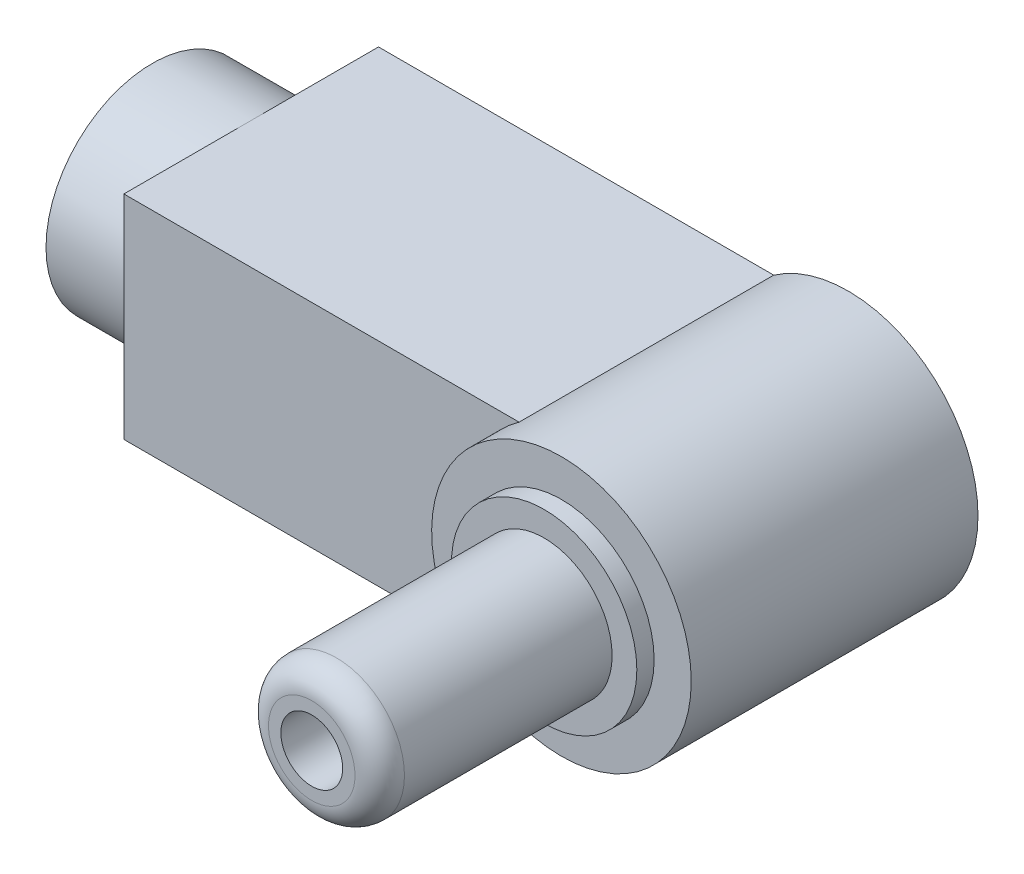
ISO-10303-21;
HEADER;
FILE_DESCRIPTION(('STEP AP214'),'2;1');
FILE_NAME('part.step','',(''),(''),'','','');
FILE_SCHEMA(('AUTOMOTIVE_DESIGN { 1 0 10303 214 1 1 1 1 }'));
ENDSEC;
DATA;
#1=APPLICATION_CONTEXT('core data for automotive mechanical design processes');
#2=APPLICATION_PROTOCOL_DEFINITION('international standard','automotive_design',2000,#1);
#3=PRODUCT_CONTEXT('',#1,'mechanical');
#4=PRODUCT('Part','Part','',(#3));
#5=PRODUCT_RELATED_PRODUCT_CATEGORY('part','',(#4));
#6=PRODUCT_DEFINITION_FORMATION('','',#4);
#7=PRODUCT_DEFINITION_CONTEXT('part definition',#1,'design');
#8=PRODUCT_DEFINITION('design','',#6,#7);
#9=PRODUCT_DEFINITION_SHAPE('','',#8);
#10=(LENGTH_UNIT() NAMED_UNIT(*) SI_UNIT(.MILLI.,.METRE.));
#11=(NAMED_UNIT(*) PLANE_ANGLE_UNIT() SI_UNIT($,.RADIAN.));
#12=(NAMED_UNIT(*) SI_UNIT($,.STERADIAN.) SOLID_ANGLE_UNIT());
#13=UNCERTAINTY_MEASURE_WITH_UNIT(LENGTH_MEASURE(1.E-05),#10,'distance_accuracy_value','');
#14=(GEOMETRIC_REPRESENTATION_CONTEXT(3) GLOBAL_UNCERTAINTY_ASSIGNED_CONTEXT((#13)) GLOBAL_UNIT_ASSIGNED_CONTEXT((#10,
#11,#12)) REPRESENTATION_CONTEXT('',''));
#15=CARTESIAN_POINT('',(0.,0.,0.));
#16=DIRECTION('',(0.,0.,1.));
#17=DIRECTION('',(1.,0.,0.));
#18=AXIS2_PLACEMENT_3D('',#15,#16,#17);
#19=CARTESIAN_POINT('',(-19.,4.3,10.3));
#20=DIRECTION('',(1.,0.,0.));
#21=DIRECTION('',(0.,0.,-1.));
#22=AXIS2_PLACEMENT_3D('',#19,#20,#21);
#23=PLANE('',#22);
#24=CARTESIAN_POINT('',(-19.,0.,5.15));
#25=DIRECTION('',(-1.,0.,0.));
#26=DIRECTION('',(0.,0.,1.));
#27=AXIS2_PLACEMENT_3D('',#24,#25,#26);
#28=CIRCLE('',#27,4.3);
#29=CARTESIAN_POINT('',(-19.,4.3,5.15));
#30=VERTEX_POINT('',#29);
#31=CARTESIAN_POINT('',(-19.,-4.3,5.15));
#32=VERTEX_POINT('',#31);
#33=EDGE_CURVE('E45',#30,#32,#28,.T.);
#34=ORIENTED_EDGE('',*,*,#33,.F.);
#35=DIRECTION('',(0.,0.,-1.));
#36=VECTOR('',#35,1.);
#37=CARTESIAN_POINT('',(-19.,4.3,10.3));
#38=LINE('',#37,#36);
#39=CARTESIAN_POINT('',(-19.,4.3,0.));
#40=VERTEX_POINT('',#39);
#41=EDGE_CURVE('E95',#30,#40,#38,.T.);
#42=ORIENTED_EDGE('',*,*,#41,.T.);
#43=DIRECTION('',(0.,-1.,0.));
#44=VECTOR('',#43,1.);
#45=CARTESIAN_POINT('',(-19.,4.3,0.));
#46=LINE('',#45,#44);
#47=CARTESIAN_POINT('',(-19.,-4.3,0.));
#48=VERTEX_POINT('',#47);
#49=EDGE_CURVE('E269',#40,#48,#46,.T.);
#50=ORIENTED_EDGE('',*,*,#49,.T.);
#51=DIRECTION('',(0.,0.,-1.));
#52=VECTOR('',#51,1.);
#53=CARTESIAN_POINT('',(-19.,-4.3,10.3));
#54=LINE('',#53,#52);
#55=EDGE_CURVE('E107',#32,#48,#54,.T.);
#56=ORIENTED_EDGE('',*,*,#55,.F.);
#57=EDGE_LOOP('',(#34,#42,#50,#56));
#58=FACE_BOUND('',#57,.T.);
#59=ADVANCED_FACE('F35',(#58),#23,.F.);
#60=EDGE_CURVE('E11',#32,#30,#28,.T.);
#61=ORIENTED_EDGE('',*,*,#60,.F.);
#62=CARTESIAN_POINT('',(-19.,-4.3,10.3));
#63=VERTEX_POINT('',#62);
#64=EDGE_CURVE('E105',#63,#32,#54,.T.);
#65=ORIENTED_EDGE('',*,*,#64,.F.);
#66=DIRECTION('',(0.,-1.,0.));
#67=VECTOR('',#66,1.);
#68=CARTESIAN_POINT('',(-19.,4.3,10.3));
#69=LINE('',#68,#67);
#70=CARTESIAN_POINT('',(-19.,4.3,10.3));
#71=VERTEX_POINT('',#70);
#72=EDGE_CURVE('E92',#71,#63,#69,.T.);
#73=ORIENTED_EDGE('',*,*,#72,.F.);
#74=EDGE_CURVE('E89',#71,#30,#38,.T.);
#75=ORIENTED_EDGE('',*,*,#74,.T.);
#76=EDGE_LOOP('',(#61,#65,#73,#75));
#77=FACE_BOUND('',#76,.T.);
#78=ADVANCED_FACE('F91',(#77),#23,.F.);
#79=CARTESIAN_POINT('',(0.,0.,12.3));
#80=DIRECTION('',(0.,0.,1.));
#81=DIRECTION('',(1.,0.,0.));
#82=AXIS2_PLACEMENT_3D('',#79,#80,#81);
#83=PLANE('',#82);
#84=CARTESIAN_POINT('',(0.,0.,12.3));
#85=DIRECTION('',(0.,0.,1.));
#86=DIRECTION('',(1.,0.,0.));
#87=AXIS2_PLACEMENT_3D('',#84,#85,#86);
#88=CIRCLE('',#87,3.75);
#89=CARTESIAN_POINT('',(3.75,0.,12.3));
#90=VERTEX_POINT('',#89);
#91=EDGE_CURVE('E158',#90,#90,#88,.T.);
#92=ORIENTED_EDGE('',*,*,#91,.T.);
#93=EDGE_LOOP('',(#92));
#94=FACE_BOUND('',#93,.T.);
#95=CARTESIAN_POINT('',(0.,0.,12.3));
#96=DIRECTION('',(0.,0.,1.));
#97=DIRECTION('',(1.,0.,0.));
#98=AXIS2_PLACEMENT_3D('',#95,#96,#97);
#99=CIRCLE('',#98,2.75);
#100=CARTESIAN_POINT('',(2.75,0.,12.3));
#101=VERTEX_POINT('',#100);
#102=EDGE_CURVE('E154',#101,#101,#99,.T.);
#103=ORIENTED_EDGE('',*,*,#102,.F.);
#104=EDGE_LOOP('',(#103));
#105=FACE_BOUND('',#104,.T.);
#106=ADVANCED_FACE('F134',(#94,#105),#83,.T.);
#107=CARTESIAN_POINT('',(0.,0.,11.6));
#108=DIRECTION('',(0.,0.,1.));
#109=DIRECTION('',(1.,0.,0.));
#110=AXIS2_PLACEMENT_3D('',#107,#108,#109);
#111=PLANE('',#110);
#112=CARTESIAN_POINT('',(0.,0.,11.6));
#113=DIRECTION('',(0.,0.,1.));
#114=DIRECTION('',(1.,0.,0.));
#115=AXIS2_PLACEMENT_3D('',#112,#113,#114);
#116=CIRCLE('',#115,5.25);
#117=CARTESIAN_POINT('',(5.25,0.,11.6));
#118=VERTEX_POINT('',#117);
#119=EDGE_CURVE('E164',#118,#118,#116,.T.);
#120=ORIENTED_EDGE('',*,*,#119,.T.);
#121=EDGE_LOOP('',(#120));
#122=FACE_BOUND('',#121,.T.);
#123=CARTESIAN_POINT('',(0.,0.,11.6));
#124=DIRECTION('',(0.,0.,1.));
#125=DIRECTION('',(1.,0.,0.));
#126=AXIS2_PLACEMENT_3D('',#123,#124,#125);
#127=CIRCLE('',#126,3.75);
#128=CARTESIAN_POINT('',(3.75,0.,11.6));
#129=VERTEX_POINT('',#128);
#130=EDGE_CURVE('E157',#129,#129,#127,.T.);
#131=ORIENTED_EDGE('',*,*,#130,.F.);
#132=EDGE_LOOP('',(#131));
#133=FACE_BOUND('',#132,.T.);
#134=ADVANCED_FACE('F217',(#122,#133),#111,.T.);
#135=CARTESIAN_POINT('',(0.,0.,10.3));
#136=DIRECTION('',(0.,0.,-1.));
#137=DIRECTION('',(-1.,0.,0.));
#138=AXIS2_PLACEMENT_3D('',#135,#136,#137);
#139=PLANE('',#138);
#140=CARTESIAN_POINT('',(0.,0.,10.3));
#141=DIRECTION('',(0.,0.,1.));
#142=DIRECTION('',(1.,0.,0.));
#143=AXIS2_PLACEMENT_3D('',#140,#141,#142);
#144=CIRCLE('',#143,5.25);
#145=CARTESIAN_POINT('',(-3.01205909636581,4.3,10.3));
#146=VERTEX_POINT('',#145);
#147=CARTESIAN_POINT('',(-3.01205909636581,-4.3,10.3));
#148=VERTEX_POINT('',#147);
#149=EDGE_CURVE('E161',#146,#148,#144,.T.);
#150=ORIENTED_EDGE('',*,*,#149,.F.);
#151=DIRECTION('',(-1.,0.,0.));
#152=VECTOR('',#151,1.);
#153=CARTESIAN_POINT('',(-3.01205909636581,4.3,10.3));
#154=LINE('',#153,#152);
#155=EDGE_CURVE('E82',#146,#71,#154,.T.);
#156=ORIENTED_EDGE('',*,*,#155,.T.);
#157=ORIENTED_EDGE('',*,*,#72,.T.);
#158=DIRECTION('',(1.,0.,0.));
#159=VECTOR('',#158,1.);
#160=CARTESIAN_POINT('',(-19.,-4.3,10.3));
#161=LINE('',#160,#159);
#162=EDGE_CURVE('E59',#63,#148,#161,.T.);
#163=ORIENTED_EDGE('',*,*,#162,.T.);
#164=EDGE_LOOP('',(#150,#156,#157,#163));
#165=FACE_BOUND('',#164,.T.);
#166=ADVANCED_FACE('F222',(#165),#139,.F.);
#167=CARTESIAN_POINT('',(0.,0.,10.3));
#168=DIRECTION('',(0.,0.,-1.));
#169=DIRECTION('',(-1.,0.,0.));
#170=AXIS2_PLACEMENT_3D('',#167,#168,#169);
#171=CYLINDRICAL_SURFACE('',#170,5.25);
#172=CARTESIAN_POINT('',(0.,0.,0.));
#173=DIRECTION('',(0.,0.,1.));
#174=DIRECTION('',(-1.,0.,0.));
#175=AXIS2_PLACEMENT_3D('',#172,#173,#174);
#176=CIRCLE('',#175,5.25);
#177=CARTESIAN_POINT('',(-3.01205909636581,-4.3,0.));
#178=VERTEX_POINT('',#177);
#179=CARTESIAN_POINT('',(-3.01205909636581,4.3,0.));
#180=VERTEX_POINT('',#179);
#181=EDGE_CURVE('E167',#178,#180,#176,.T.);
#182=ORIENTED_EDGE('',*,*,#181,.T.);
#183=DIRECTION('',(0.,0.,-1.));
#184=VECTOR('',#183,1.);
#185=CARTESIAN_POINT('',(-3.01205909636581,4.3,10.3));
#186=LINE('',#185,#184);
#187=EDGE_CURVE('E94',#146,#180,#186,.T.);
#188=ORIENTED_EDGE('',*,*,#187,.F.);
#189=ORIENTED_EDGE('',*,*,#149,.T.);
#190=DIRECTION('',(0.,0.,-1.));
#191=VECTOR('',#190,1.);
#192=CARTESIAN_POINT('',(-3.01205909636581,-4.3,10.3));
#193=LINE('',#192,#191);
#194=EDGE_CURVE('E183',#148,#178,#193,.T.);
#195=ORIENTED_EDGE('',*,*,#194,.T.);
#196=EDGE_LOOP('',(#182,#188,#189,#195));
#197=FACE_BOUND('',#196,.T.);
#198=ORIENTED_EDGE('',*,*,#119,.F.);
#199=EDGE_LOOP('',(#198));
#200=FACE_BOUND('',#199,.T.);
#201=ADVANCED_FACE('F252',(#197,#200),#171,.T.);
#202=CARTESIAN_POINT('',(-3.01205909636581,4.3,10.3));
#203=DIRECTION('',(0.,-1.,0.));
#204=DIRECTION('',(0.,0.,-1.));
#205=AXIS2_PLACEMENT_3D('',#202,#203,#204);
#206=PLANE('',#205);
#207=DIRECTION('',(-1.,0.,0.));
#208=VECTOR('',#207,1.);
#209=CARTESIAN_POINT('',(-3.01205909636581,4.3,0.));
#210=LINE('',#209,#208);
#211=EDGE_CURVE('E101',#180,#40,#210,.T.);
#212=ORIENTED_EDGE('',*,*,#211,.T.);
#213=ORIENTED_EDGE('',*,*,#41,.F.);
#214=ORIENTED_EDGE('',*,*,#74,.F.);
#215=ORIENTED_EDGE('',*,*,#155,.F.);
#216=ORIENTED_EDGE('',*,*,#187,.T.);
#217=EDGE_LOOP('',(#212,#213,#214,#215,#216));
#218=FACE_BOUND('',#217,.T.);
#219=ADVANCED_FACE('F99',(#218),#206,.F.);
#220=CARTESIAN_POINT('',(-19.,-4.3,10.3));
#221=DIRECTION('',(0.,1.,0.));
#222=DIRECTION('',(0.,0.,1.));
#223=AXIS2_PLACEMENT_3D('',#220,#221,#222);
#224=PLANE('',#223);
#225=DIRECTION('',(1.,0.,0.));
#226=VECTOR('',#225,1.);
#227=CARTESIAN_POINT('',(-19.,-4.3,0.));
#228=LINE('',#227,#226);
#229=EDGE_CURVE('E78',#48,#178,#228,.T.);
#230=ORIENTED_EDGE('',*,*,#229,.T.);
#231=ORIENTED_EDGE('',*,*,#194,.F.);
#232=ORIENTED_EDGE('',*,*,#162,.F.);
#233=ORIENTED_EDGE('',*,*,#64,.T.);
#234=ORIENTED_EDGE('',*,*,#55,.T.);
#235=EDGE_LOOP('',(#230,#231,#232,#233,#234));
#236=FACE_BOUND('',#235,.T.);
#237=ADVANCED_FACE('F246',(#236),#224,.F.);
#238=CARTESIAN_POINT('',(0.,0.,0.));
#239=DIRECTION('',(0.,0.,-1.));
#240=DIRECTION('',(-1.,0.,0.));
#241=AXIS2_PLACEMENT_3D('',#238,#239,#240);
#242=PLANE('',#241);
#243=ORIENTED_EDGE('',*,*,#181,.F.);
#244=ORIENTED_EDGE('',*,*,#229,.F.);
#245=ORIENTED_EDGE('',*,*,#49,.F.);
#246=ORIENTED_EDGE('',*,*,#211,.F.);
#247=EDGE_LOOP('',(#243,#244,#245,#246));
#248=FACE_BOUND('',#247,.T.);
#249=ADVANCED_FACE('F238',(#248),#242,.T.);
#250=CARTESIAN_POINT('',(0.,0.,12.3));
#251=DIRECTION('',(0.,0.,-1.));
#252=DIRECTION('',(-1.,0.,0.));
#253=AXIS2_PLACEMENT_3D('',#250,#251,#252);
#254=CYLINDRICAL_SURFACE('',#253,3.75);
#255=ORIENTED_EDGE('',*,*,#91,.F.);
#256=EDGE_LOOP('',(#255));
#257=FACE_BOUND('',#256,.T.);
#258=ORIENTED_EDGE('',*,*,#130,.T.);
#259=EDGE_LOOP('',(#258));
#260=FACE_BOUND('',#259,.T.);
#261=ADVANCED_FACE('F233',(#257,#260),#254,.T.);
#262=CARTESIAN_POINT('',(0.,0.,21.7));
#263=DIRECTION('',(0.,0.,1.));
#264=DIRECTION('',(1.,0.,0.));
#265=AXIS2_PLACEMENT_3D('',#262,#263,#264);
#266=PLANE('',#265);
#267=CARTESIAN_POINT('',(0.,0.,21.7));
#268=DIRECTION('',(0.,0.,1.));
#269=DIRECTION('',(1.,0.,0.));
#270=AXIS2_PLACEMENT_3D('',#267,#268,#269);
#271=CIRCLE('',#270,1.75);
#272=CARTESIAN_POINT('',(1.75,0.,21.7));
#273=VERTEX_POINT('',#272);
#274=EDGE_CURVE('E190',#273,#273,#271,.T.);
#275=ORIENTED_EDGE('',*,*,#274,.T.);
#276=EDGE_LOOP('',(#275));
#277=FACE_BOUND('',#276,.T.);
#278=CARTESIAN_POINT('',(0.,0.,21.7));
#279=DIRECTION('',(0.,0.,1.));
#280=DIRECTION('',(1.,0.,0.));
#281=AXIS2_PLACEMENT_3D('',#278,#279,#280);
#282=CIRCLE('',#281,1.25);
#283=CARTESIAN_POINT('',(1.25,0.,21.7));
#284=VERTEX_POINT('',#283);
#285=EDGE_CURVE('E150',#284,#284,#282,.T.);
#286=ORIENTED_EDGE('',*,*,#285,.F.);
#287=EDGE_LOOP('',(#286));
#288=FACE_BOUND('',#287,.T.);
#289=ADVANCED_FACE('F229',(#277,#288),#266,.T.);
#290=CARTESIAN_POINT('',(0.,0.,21.7));
#291=DIRECTION('',(0.,0.,-1.));
#292=DIRECTION('',(-1.,0.,0.));
#293=AXIS2_PLACEMENT_3D('',#290,#291,#292);
#294=CYLINDRICAL_SURFACE('',#293,2.75);
#295=CARTESIAN_POINT('',(0.,0.,20.7));
#296=DIRECTION('',(0.,0.,1.));
#297=DIRECTION('',(1.,0.,0.));
#298=AXIS2_PLACEMENT_3D('',#295,#296,#297);
#299=CIRCLE('',#298,2.75);
#300=CARTESIAN_POINT('',(2.75,0.,20.7));
#301=VERTEX_POINT('',#300);
#302=EDGE_CURVE('E39',#301,#301,#299,.F.);
#303=ORIENTED_EDGE('',*,*,#302,.T.);
#304=EDGE_LOOP('',(#303));
#305=FACE_BOUND('',#304,.T.);
#306=ORIENTED_EDGE('',*,*,#102,.T.);
#307=EDGE_LOOP('',(#306));
#308=FACE_BOUND('',#307,.T.);
#309=ADVANCED_FACE('F197',(#305,#308),#294,.T.);
#310=CARTESIAN_POINT('',(0.,0.,21.7));
#311=DIRECTION('',(0.,0.,-1.));
#312=DIRECTION('',(-1.,0.,0.));
#313=AXIS2_PLACEMENT_3D('',#310,#311,#312);
#314=CYLINDRICAL_SURFACE('',#313,1.25);
#315=ORIENTED_EDGE('',*,*,#285,.T.);
#316=EDGE_LOOP('',(#315));
#317=FACE_BOUND('',#316,.T.);
#318=CARTESIAN_POINT('',(0.,0.,12.3));
#319=DIRECTION('',(0.,0.,1.));
#320=DIRECTION('',(1.,0.,0.));
#321=AXIS2_PLACEMENT_3D('',#318,#319,#320);
#322=CIRCLE('',#321,1.25);
#323=CARTESIAN_POINT('',(1.25,0.,12.3));
#324=VERTEX_POINT('',#323);
#325=EDGE_CURVE('E176',#324,#324,#322,.F.);
#326=ORIENTED_EDGE('',*,*,#325,.T.);
#327=EDGE_LOOP('',(#326));
#328=FACE_BOUND('',#327,.T.);
#329=ADVANCED_FACE('F206',(#317,#328),#314,.F.);
#330=ORIENTED_EDGE('',*,*,#325,.F.);
#331=EDGE_LOOP('',(#330));
#332=FACE_BOUND('',#331,.T.);
#333=ADVANCED_FACE('F202',(#332),#83,.T.);
#334=CARTESIAN_POINT('',(0.,0.,20.7));
#335=DIRECTION('',(0.,0.,1.));
#336=DIRECTION('',(1.,0.,0.));
#337=AXIS2_PLACEMENT_3D('',#334,#335,#336);
#338=TOROIDAL_SURFACE('',#337,1.75,1.);
#339=ORIENTED_EDGE('',*,*,#302,.F.);
#340=EDGE_LOOP('',(#339));
#341=FACE_BOUND('',#340,.T.);
#342=ORIENTED_EDGE('',*,*,#274,.F.);
#343=EDGE_LOOP('',(#342));
#344=FACE_BOUND('',#343,.T.);
#345=ADVANCED_FACE('F37',(#341,#344),#338,.T.);
#346=CARTESIAN_POINT('',(-23.,0.,5.15));
#347=DIRECTION('',(-1.,0.,0.));
#348=DIRECTION('',(0.,0.,1.));
#349=AXIS2_PLACEMENT_3D('',#346,#347,#348);
#350=PLANE('',#349);
#351=CARTESIAN_POINT('',(-23.,0.,5.15));
#352=DIRECTION('',(-1.,0.,0.));
#353=DIRECTION('',(0.,0.,1.));
#354=AXIS2_PLACEMENT_3D('',#351,#352,#353);
#355=CIRCLE('',#354,4.3);
#356=CARTESIAN_POINT('',(-23.,0.,9.45));
#357=VERTEX_POINT('',#356);
#358=EDGE_CURVE('E110',#357,#357,#355,.T.);
#359=ORIENTED_EDGE('',*,*,#358,.T.);
#360=EDGE_LOOP('',(#359));
#361=FACE_BOUND('',#360,.T.);
#362=CARTESIAN_POINT('',(-23.,0.,5.15));
#363=DIRECTION('',(-1.,0.,0.));
#364=DIRECTION('',(0.,0.,1.));
#365=AXIS2_PLACEMENT_3D('',#362,#363,#364);
#366=CIRCLE('',#365,2.75);
#367=CARTESIAN_POINT('',(-23.,0.,7.9));
#368=VERTEX_POINT('',#367);
#369=EDGE_CURVE('E111',#368,#368,#366,.T.);
#370=ORIENTED_EDGE('',*,*,#369,.F.);
#371=EDGE_LOOP('',(#370));
#372=FACE_BOUND('',#371,.T.);
#373=ADVANCED_FACE('F115',(#361,#372),#350,.T.);
#374=CARTESIAN_POINT('',(-23.,0.,5.15));
#375=DIRECTION('',(1.,0.,0.));
#376=DIRECTION('',(0.,0.,-1.));
#377=AXIS2_PLACEMENT_3D('',#374,#375,#376);
#378=CYLINDRICAL_SURFACE('',#377,4.3);
#379=ORIENTED_EDGE('',*,*,#358,.F.);
#380=EDGE_LOOP('',(#379));
#381=FACE_BOUND('',#380,.T.);
#382=ORIENTED_EDGE('',*,*,#33,.T.);
#383=ORIENTED_EDGE('',*,*,#60,.T.);
#384=EDGE_LOOP('',(#382,#383));
#385=FACE_BOUND('',#384,.T.);
#386=ADVANCED_FACE('F112',(#381,#385),#378,.T.);
#387=CARTESIAN_POINT('',(-23.,0.,5.15));
#388=DIRECTION('',(1.,0.,0.));
#389=DIRECTION('',(0.,0.,-1.));
#390=AXIS2_PLACEMENT_3D('',#387,#388,#389);
#391=CYLINDRICAL_SURFACE('',#390,2.75);
#392=ORIENTED_EDGE('',*,*,#369,.T.);
#393=EDGE_LOOP('',(#392));
#394=FACE_BOUND('',#393,.T.);
#395=CARTESIAN_POINT('',(-19.,0.,5.15));
#396=DIRECTION('',(-1.,0.,0.));
#397=DIRECTION('',(0.,0.,1.));
#398=AXIS2_PLACEMENT_3D('',#395,#396,#397);
#399=CIRCLE('',#398,2.75);
#400=CARTESIAN_POINT('',(-19.,0.,7.9));
#401=VERTEX_POINT('',#400);
#402=EDGE_CURVE('E143',#401,#401,#399,.T.);
#403=ORIENTED_EDGE('',*,*,#402,.F.);
#404=EDGE_LOOP('',(#403));
#405=FACE_BOUND('',#404,.T.);
#406=ADVANCED_FACE('F114',(#394,#405),#391,.F.);
#407=ORIENTED_EDGE('',*,*,#402,.T.);
#408=EDGE_LOOP('',(#407));
#409=FACE_BOUND('',#408,.T.);
#410=ADVANCED_FACE('F122',(#409),#23,.F.);
#411=CLOSED_SHELL('',(#59,#78,#106,#134,#166,#201,#219,#237,#249,#261,#289,#309,#329,#333,#345,
#373,#386,#406,#410));
#412=MANIFOLD_SOLID_BREP('B2',#411);
#413=ADVANCED_BREP_SHAPE_REPRESENTATION('',(#18,#412),#14);
#414=SHAPE_DEFINITION_REPRESENTATION(#9,#413);
ENDSEC;
END-ISO-10303-21;
